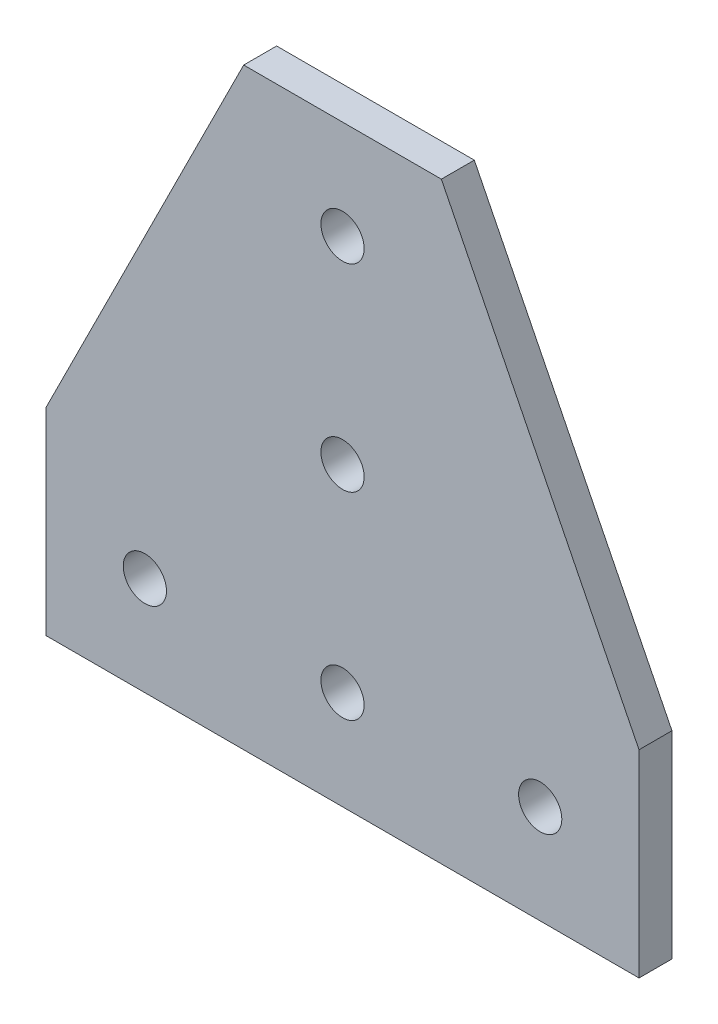
ISO-10303-21;
HEADER;
FILE_DESCRIPTION(('STEP AP214'),'2;1');
FILE_NAME('part.step','',(''),(''),'','','');
FILE_SCHEMA(('AUTOMOTIVE_DESIGN { 1 0 10303 214 1 1 1 1 }'));
ENDSEC;
DATA;
#1=APPLICATION_CONTEXT('core data for automotive mechanical design processes');
#2=APPLICATION_PROTOCOL_DEFINITION('international standard','automotive_design',2000,#1);
#3=PRODUCT_CONTEXT('',#1,'mechanical');
#4=PRODUCT('Part','Part','',(#3));
#5=PRODUCT_RELATED_PRODUCT_CATEGORY('part','',(#4));
#6=PRODUCT_DEFINITION_FORMATION('','',#4);
#7=PRODUCT_DEFINITION_CONTEXT('part definition',#1,'design');
#8=PRODUCT_DEFINITION('design','',#6,#7);
#9=PRODUCT_DEFINITION_SHAPE('','',#8);
#10=(LENGTH_UNIT() NAMED_UNIT(*) SI_UNIT(.MILLI.,.METRE.));
#11=(NAMED_UNIT(*) PLANE_ANGLE_UNIT() SI_UNIT($,.RADIAN.));
#12=(NAMED_UNIT(*) SI_UNIT($,.STERADIAN.) SOLID_ANGLE_UNIT());
#13=UNCERTAINTY_MEASURE_WITH_UNIT(LENGTH_MEASURE(1.E-05),#10,'distance_accuracy_value','');
#14=(GEOMETRIC_REPRESENTATION_CONTEXT(3) GLOBAL_UNCERTAINTY_ASSIGNED_CONTEXT((#13)) GLOBAL_UNIT_ASSIGNED_CONTEXT((#10,
#11,#12)) REPRESENTATION_CONTEXT('',''));
#15=CARTESIAN_POINT('',(0.,0.,0.));
#16=DIRECTION('',(0.,0.,1.));
#17=DIRECTION('',(1.,0.,0.));
#18=AXIS2_PLACEMENT_3D('',#15,#16,#17);
#19=CARTESIAN_POINT('',(0.,0.,3.175));
#20=DIRECTION('',(0.,0.,-1.));
#21=DIRECTION('',(-1.,0.,0.));
#22=AXIS2_PLACEMENT_3D('',#19,#20,#21);
#23=PLANE('',#22);
#24=CARTESIAN_POINT('',(57.15,95.25,3.175));
#25=DIRECTION('',(0.,0.,1.));
#26=DIRECTION('',(1.,0.,0.));
#27=AXIS2_PLACEMENT_3D('',#24,#25,#26);
#28=CIRCLE('',#27,4.1656);
#29=CARTESIAN_POINT('',(61.3156,95.25,3.175));
#30=VERTEX_POINT('',#29);
#31=EDGE_CURVE('E193',#30,#30,#28,.T.);
#32=ORIENTED_EDGE('',*,*,#31,.F.);
#33=EDGE_LOOP('',(#32));
#34=FACE_BOUND('',#33,.T.);
#35=CARTESIAN_POINT('',(57.15,19.05,3.175));
#36=DIRECTION('',(0.,0.,1.));
#37=DIRECTION('',(1.,0.,0.));
#38=AXIS2_PLACEMENT_3D('',#35,#36,#37);
#39=CIRCLE('',#38,4.1656);
#40=CARTESIAN_POINT('',(61.3156,19.05,3.175));
#41=VERTEX_POINT('',#40);
#42=EDGE_CURVE('E205',#41,#41,#39,.T.);
#43=ORIENTED_EDGE('',*,*,#42,.F.);
#44=EDGE_LOOP('',(#43));
#45=FACE_BOUND('',#44,.T.);
#46=DIRECTION('',(1.,0.,0.));
#47=VECTOR('',#46,1.);
#48=CARTESIAN_POINT('',(114.3,0.,3.175));
#49=LINE('',#48,#47);
#50=CARTESIAN_POINT('',(0.,0.,3.175));
#51=VERTEX_POINT('',#50);
#52=CARTESIAN_POINT('',(114.3,0.,3.175));
#53=VERTEX_POINT('',#52);
#54=EDGE_CURVE('E128',#51,#53,#49,.T.);
#55=ORIENTED_EDGE('',*,*,#54,.T.);
#56=DIRECTION('',(0.,1.,0.));
#57=VECTOR('',#56,1.);
#58=CARTESIAN_POINT('',(114.3,38.1,3.175));
#59=LINE('',#58,#57);
#60=CARTESIAN_POINT('',(114.3,38.1,3.175));
#61=VERTEX_POINT('',#60);
#62=EDGE_CURVE('E86',#53,#61,#59,.T.);
#63=ORIENTED_EDGE('',*,*,#62,.T.);
#64=DIRECTION('',(-0.447213595499958,0.894427190999916,0.));
#65=VECTOR('',#64,1.);
#66=CARTESIAN_POINT('',(114.3,38.1,3.175));
#67=LINE('',#66,#65);
#68=CARTESIAN_POINT('',(76.2,114.3,3.175));
#69=VERTEX_POINT('',#68);
#70=EDGE_CURVE('E99',#61,#69,#67,.T.);
#71=ORIENTED_EDGE('',*,*,#70,.T.);
#72=DIRECTION('',(-1.,0.,0.));
#73=VECTOR('',#72,1.);
#74=CARTESIAN_POINT('',(38.1,114.3,3.175));
#75=LINE('',#74,#73);
#76=CARTESIAN_POINT('',(38.1,114.3,3.175));
#77=VERTEX_POINT('',#76);
#78=EDGE_CURVE('E93',#69,#77,#75,.T.);
#79=ORIENTED_EDGE('',*,*,#78,.T.);
#80=DIRECTION('',(-0.447213595499958,-0.894427190999916,0.));
#81=VECTOR('',#80,1.);
#82=CARTESIAN_POINT('',(0.,38.1,3.175));
#83=LINE('',#82,#81);
#84=CARTESIAN_POINT('',(0.,38.1,3.175));
#85=VERTEX_POINT('',#84);
#86=EDGE_CURVE('E97',#77,#85,#83,.T.);
#87=ORIENTED_EDGE('',*,*,#86,.T.);
#88=DIRECTION('',(0.,-1.,0.));
#89=VECTOR('',#88,1.);
#90=CARTESIAN_POINT('',(0.,0.,3.175));
#91=LINE('',#90,#89);
#92=EDGE_CURVE('E49',#85,#51,#91,.T.);
#93=ORIENTED_EDGE('',*,*,#92,.T.);
#94=EDGE_LOOP('',(#55,#63,#71,#79,#87,#93));
#95=FACE_BOUND('',#94,.T.);
#96=CARTESIAN_POINT('',(19.05,19.05,3.175));
#97=DIRECTION('',(0.,0.,1.));
#98=DIRECTION('',(1.,0.,0.));
#99=AXIS2_PLACEMENT_3D('',#96,#97,#98);
#100=CIRCLE('',#99,4.1656);
#101=CARTESIAN_POINT('',(23.2156,19.05,3.175));
#102=VERTEX_POINT('',#101);
#103=EDGE_CURVE('E121',#102,#102,#100,.T.);
#104=ORIENTED_EDGE('',*,*,#103,.F.);
#105=EDGE_LOOP('',(#104));
#106=FACE_BOUND('',#105,.T.);
#107=CARTESIAN_POINT('',(95.25,19.05,3.175));
#108=DIRECTION('',(0.,0.,1.));
#109=DIRECTION('',(1.,0.,0.));
#110=AXIS2_PLACEMENT_3D('',#107,#108,#109);
#111=CIRCLE('',#110,4.1656);
#112=CARTESIAN_POINT('',(99.4156,19.05,3.175));
#113=VERTEX_POINT('',#112);
#114=EDGE_CURVE('E199',#113,#113,#111,.T.);
#115=ORIENTED_EDGE('',*,*,#114,.F.);
#116=EDGE_LOOP('',(#115));
#117=FACE_BOUND('',#116,.T.);
#118=CARTESIAN_POINT('',(57.15,57.15,3.175));
#119=DIRECTION('',(0.,0.,1.));
#120=DIRECTION('',(1.,0.,0.));
#121=AXIS2_PLACEMENT_3D('',#118,#119,#120);
#122=CIRCLE('',#121,4.1656);
#123=CARTESIAN_POINT('',(61.3156,57.15,3.175));
#124=VERTEX_POINT('',#123);
#125=EDGE_CURVE('E184',#124,#124,#122,.T.);
#126=ORIENTED_EDGE('',*,*,#125,.F.);
#127=EDGE_LOOP('',(#126));
#128=FACE_BOUND('',#127,.T.);
#129=ADVANCED_FACE('F32',(#34,#45,#95,#106,#117,#128),#23,.F.);
#130=CARTESIAN_POINT('',(0.,0.,-3.175));
#131=DIRECTION('',(0.,0.,-1.));
#132=DIRECTION('',(-1.,0.,0.));
#133=AXIS2_PLACEMENT_3D('',#130,#131,#132);
#134=PLANE('',#133);
#135=CARTESIAN_POINT('',(57.15,95.25,-3.175));
#136=DIRECTION('',(0.,0.,1.));
#137=DIRECTION('',(1.,0.,0.));
#138=AXIS2_PLACEMENT_3D('',#135,#136,#137);
#139=CIRCLE('',#138,4.1656);
#140=CARTESIAN_POINT('',(61.3156,95.25,-3.175));
#141=VERTEX_POINT('',#140);
#142=EDGE_CURVE('E190',#141,#141,#139,.T.);
#143=ORIENTED_EDGE('',*,*,#142,.T.);
#144=EDGE_LOOP('',(#143));
#145=FACE_BOUND('',#144,.T.);
#146=CARTESIAN_POINT('',(57.15,19.05,-3.175));
#147=DIRECTION('',(0.,0.,1.));
#148=DIRECTION('',(1.,0.,0.));
#149=AXIS2_PLACEMENT_3D('',#146,#147,#148);
#150=CIRCLE('',#149,4.1656);
#151=CARTESIAN_POINT('',(61.3156,19.05,-3.175));
#152=VERTEX_POINT('',#151);
#153=EDGE_CURVE('E202',#152,#152,#150,.T.);
#154=ORIENTED_EDGE('',*,*,#153,.T.);
#155=EDGE_LOOP('',(#154));
#156=FACE_BOUND('',#155,.T.);
#157=DIRECTION('',(1.,0.,0.));
#158=VECTOR('',#157,1.);
#159=CARTESIAN_POINT('',(114.3,0.,-3.175));
#160=LINE('',#159,#158);
#161=CARTESIAN_POINT('',(0.,0.,-3.175));
#162=VERTEX_POINT('',#161);
#163=CARTESIAN_POINT('',(114.3,0.,-3.175));
#164=VERTEX_POINT('',#163);
#165=EDGE_CURVE('E117',#162,#164,#160,.T.);
#166=ORIENTED_EDGE('',*,*,#165,.F.);
#167=DIRECTION('',(0.,-1.,0.));
#168=VECTOR('',#167,1.);
#169=CARTESIAN_POINT('',(0.,0.,-3.175));
#170=LINE('',#169,#168);
#171=CARTESIAN_POINT('',(0.,38.1,-3.175));
#172=VERTEX_POINT('',#171);
#173=EDGE_CURVE('E78',#172,#162,#170,.T.);
#174=ORIENTED_EDGE('',*,*,#173,.F.);
#175=DIRECTION('',(-0.447213595499958,-0.894427190999916,0.));
#176=VECTOR('',#175,1.);
#177=CARTESIAN_POINT('',(0.,38.1,-3.175));
#178=LINE('',#177,#176);
#179=CARTESIAN_POINT('',(38.1,114.3,-3.175));
#180=VERTEX_POINT('',#179);
#181=EDGE_CURVE('E72',#180,#172,#178,.T.);
#182=ORIENTED_EDGE('',*,*,#181,.F.);
#183=DIRECTION('',(-1.,0.,0.));
#184=VECTOR('',#183,1.);
#185=CARTESIAN_POINT('',(38.1,114.3,-3.175));
#186=LINE('',#185,#184);
#187=CARTESIAN_POINT('',(76.2,114.3,-3.175));
#188=VERTEX_POINT('',#187);
#189=EDGE_CURVE('E107',#188,#180,#186,.T.);
#190=ORIENTED_EDGE('',*,*,#189,.F.);
#191=DIRECTION('',(-0.447213595499958,0.894427190999916,0.));
#192=VECTOR('',#191,1.);
#193=CARTESIAN_POINT('',(114.3,38.1,-3.175));
#194=LINE('',#193,#192);
#195=CARTESIAN_POINT('',(114.3,38.1,-3.175));
#196=VERTEX_POINT('',#195);
#197=EDGE_CURVE('E123',#196,#188,#194,.T.);
#198=ORIENTED_EDGE('',*,*,#197,.F.);
#199=DIRECTION('',(0.,1.,0.));
#200=VECTOR('',#199,1.);
#201=CARTESIAN_POINT('',(114.3,38.1,-3.175));
#202=LINE('',#201,#200);
#203=EDGE_CURVE('E120',#164,#196,#202,.T.);
#204=ORIENTED_EDGE('',*,*,#203,.F.);
#205=EDGE_LOOP('',(#166,#174,#182,#190,#198,#204));
#206=FACE_BOUND('',#205,.T.);
#207=CARTESIAN_POINT('',(19.05,19.05,-3.175));
#208=DIRECTION('',(0.,0.,1.));
#209=DIRECTION('',(1.,0.,0.));
#210=AXIS2_PLACEMENT_3D('',#207,#208,#209);
#211=CIRCLE('',#210,4.1656);
#212=CARTESIAN_POINT('',(23.2156,19.05,-3.175));
#213=VERTEX_POINT('',#212);
#214=EDGE_CURVE('E208',#213,#213,#211,.T.);
#215=ORIENTED_EDGE('',*,*,#214,.T.);
#216=EDGE_LOOP('',(#215));
#217=FACE_BOUND('',#216,.T.);
#218=CARTESIAN_POINT('',(95.25,19.05,-3.175));
#219=DIRECTION('',(0.,0.,1.));
#220=DIRECTION('',(1.,0.,0.));
#221=AXIS2_PLACEMENT_3D('',#218,#219,#220);
#222=CIRCLE('',#221,4.1656);
#223=CARTESIAN_POINT('',(99.4156,19.05,-3.175));
#224=VERTEX_POINT('',#223);
#225=EDGE_CURVE('E196',#224,#224,#222,.T.);
#226=ORIENTED_EDGE('',*,*,#225,.T.);
#227=EDGE_LOOP('',(#226));
#228=FACE_BOUND('',#227,.T.);
#229=CARTESIAN_POINT('',(57.15,57.15,-3.175));
#230=DIRECTION('',(0.,0.,1.));
#231=DIRECTION('',(1.,0.,0.));
#232=AXIS2_PLACEMENT_3D('',#229,#230,#231);
#233=CIRCLE('',#232,4.1656);
#234=CARTESIAN_POINT('',(61.3156,57.15,-3.175));
#235=VERTEX_POINT('',#234);
#236=EDGE_CURVE('E187',#235,#235,#233,.T.);
#237=ORIENTED_EDGE('',*,*,#236,.T.);
#238=EDGE_LOOP('',(#237));
#239=FACE_BOUND('',#238,.T.);
#240=ADVANCED_FACE('F137',(#145,#156,#206,#217,#228,#239),#134,.T.);
#241=CARTESIAN_POINT('',(114.3,0.,3.175));
#242=DIRECTION('',(0.,1.,0.));
#243=DIRECTION('',(-1.,0.,0.));
#244=AXIS2_PLACEMENT_3D('',#241,#242,#243);
#245=PLANE('',#244);
#246=ORIENTED_EDGE('',*,*,#165,.T.);
#247=DIRECTION('',(0.,0.,-1.));
#248=VECTOR('',#247,1.);
#249=CARTESIAN_POINT('',(114.3,0.,3.175));
#250=LINE('',#249,#248);
#251=EDGE_CURVE('E11',#53,#164,#250,.T.);
#252=ORIENTED_EDGE('',*,*,#251,.F.);
#253=ORIENTED_EDGE('',*,*,#54,.F.);
#254=DIRECTION('',(0.,0.,-1.));
#255=VECTOR('',#254,1.);
#256=CARTESIAN_POINT('',(0.,0.,3.175));
#257=LINE('',#256,#255);
#258=EDGE_CURVE('E113',#51,#162,#257,.T.);
#259=ORIENTED_EDGE('',*,*,#258,.T.);
#260=EDGE_LOOP('',(#246,#252,#253,#259));
#261=FACE_BOUND('',#260,.T.);
#262=ADVANCED_FACE('F34',(#261),#245,.F.);
#263=CARTESIAN_POINT('',(114.3,38.1,3.175));
#264=DIRECTION('',(-1.,0.,0.));
#265=DIRECTION('',(0.,0.,1.));
#266=AXIS2_PLACEMENT_3D('',#263,#264,#265);
#267=PLANE('',#266);
#268=ORIENTED_EDGE('',*,*,#203,.T.);
#269=DIRECTION('',(0.,0.,-1.));
#270=VECTOR('',#269,1.);
#271=CARTESIAN_POINT('',(114.3,38.1,3.175));
#272=LINE('',#271,#270);
#273=EDGE_CURVE('E41',#61,#196,#272,.T.);
#274=ORIENTED_EDGE('',*,*,#273,.F.);
#275=ORIENTED_EDGE('',*,*,#62,.F.);
#276=ORIENTED_EDGE('',*,*,#251,.T.);
#277=EDGE_LOOP('',(#268,#274,#275,#276));
#278=FACE_BOUND('',#277,.T.);
#279=ADVANCED_FACE('F274',(#278),#267,.F.);
#280=CARTESIAN_POINT('',(114.3,38.1,3.175));
#281=DIRECTION('',(-0.894427190999916,-0.447213595499958,0.));
#282=DIRECTION('',(0.447213595499958,-0.894427190999916,0.));
#283=AXIS2_PLACEMENT_3D('',#280,#281,#282);
#284=PLANE('',#283);
#285=ORIENTED_EDGE('',*,*,#197,.T.);
#286=DIRECTION('',(0.,0.,-1.));
#287=VECTOR('',#286,1.);
#288=CARTESIAN_POINT('',(76.2,114.3,3.175));
#289=LINE('',#288,#287);
#290=EDGE_CURVE('E108',#69,#188,#289,.T.);
#291=ORIENTED_EDGE('',*,*,#290,.F.);
#292=ORIENTED_EDGE('',*,*,#70,.F.);
#293=ORIENTED_EDGE('',*,*,#273,.T.);
#294=EDGE_LOOP('',(#285,#291,#292,#293));
#295=FACE_BOUND('',#294,.T.);
#296=ADVANCED_FACE('F134',(#295),#284,.F.);
#297=CARTESIAN_POINT('',(38.1,114.3,3.175));
#298=DIRECTION('',(0.,-1.,0.));
#299=DIRECTION('',(0.,0.,-1.));
#300=AXIS2_PLACEMENT_3D('',#297,#298,#299);
#301=PLANE('',#300);
#302=ORIENTED_EDGE('',*,*,#189,.T.);
#303=DIRECTION('',(0.,0.,-1.));
#304=VECTOR('',#303,1.);
#305=CARTESIAN_POINT('',(38.1,114.3,3.175));
#306=LINE('',#305,#304);
#307=EDGE_CURVE('E104',#77,#180,#306,.T.);
#308=ORIENTED_EDGE('',*,*,#307,.F.);
#309=ORIENTED_EDGE('',*,*,#78,.F.);
#310=ORIENTED_EDGE('',*,*,#290,.T.);
#311=EDGE_LOOP('',(#302,#308,#309,#310));
#312=FACE_BOUND('',#311,.T.);
#313=ADVANCED_FACE('F105',(#312),#301,.F.);
#314=CARTESIAN_POINT('',(0.,38.1,3.175));
#315=DIRECTION('',(0.894427190999916,-0.447213595499958,0.));
#316=DIRECTION('',(0.447213595499958,0.894427190999916,0.));
#317=AXIS2_PLACEMENT_3D('',#314,#315,#316);
#318=PLANE('',#317);
#319=ORIENTED_EDGE('',*,*,#181,.T.);
#320=DIRECTION('',(0.,0.,-1.));
#321=VECTOR('',#320,1.);
#322=CARTESIAN_POINT('',(0.,38.1,3.175));
#323=LINE('',#322,#321);
#324=EDGE_CURVE('E109',#85,#172,#323,.T.);
#325=ORIENTED_EDGE('',*,*,#324,.F.);
#326=ORIENTED_EDGE('',*,*,#86,.F.);
#327=ORIENTED_EDGE('',*,*,#307,.T.);
#328=EDGE_LOOP('',(#319,#325,#326,#327));
#329=FACE_BOUND('',#328,.T.);
#330=ADVANCED_FACE('F111',(#329),#318,.F.);
#331=CARTESIAN_POINT('',(0.,0.,3.175));
#332=DIRECTION('',(1.,0.,0.));
#333=DIRECTION('',(0.,0.,-1.));
#334=AXIS2_PLACEMENT_3D('',#331,#332,#333);
#335=PLANE('',#334);
#336=ORIENTED_EDGE('',*,*,#173,.T.);
#337=ORIENTED_EDGE('',*,*,#258,.F.);
#338=ORIENTED_EDGE('',*,*,#92,.F.);
#339=ORIENTED_EDGE('',*,*,#324,.T.);
#340=EDGE_LOOP('',(#336,#337,#338,#339));
#341=FACE_BOUND('',#340,.T.);
#342=ADVANCED_FACE('F142',(#341),#335,.F.);
#343=CARTESIAN_POINT('',(19.05,19.05,3.175));
#344=DIRECTION('',(0.,0.,-1.));
#345=DIRECTION('',(-1.,0.,0.));
#346=AXIS2_PLACEMENT_3D('',#343,#344,#345);
#347=CYLINDRICAL_SURFACE('',#346,4.1656);
#348=ORIENTED_EDGE('',*,*,#103,.T.);
#349=EDGE_LOOP('',(#348));
#350=FACE_BOUND('',#349,.T.);
#351=ORIENTED_EDGE('',*,*,#214,.F.);
#352=EDGE_LOOP('',(#351));
#353=FACE_BOUND('',#352,.T.);
#354=ADVANCED_FACE('F144',(#350,#353),#347,.F.);
#355=CARTESIAN_POINT('',(57.15,19.05,3.175));
#356=DIRECTION('',(0.,0.,-1.));
#357=DIRECTION('',(-1.,0.,0.));
#358=AXIS2_PLACEMENT_3D('',#355,#356,#357);
#359=CYLINDRICAL_SURFACE('',#358,4.1656);
#360=ORIENTED_EDGE('',*,*,#42,.T.);
#361=EDGE_LOOP('',(#360));
#362=FACE_BOUND('',#361,.T.);
#363=ORIENTED_EDGE('',*,*,#153,.F.);
#364=EDGE_LOOP('',(#363));
#365=FACE_BOUND('',#364,.T.);
#366=ADVANCED_FACE('F150',(#362,#365),#359,.F.);
#367=CARTESIAN_POINT('',(95.25,19.05,3.175));
#368=DIRECTION('',(0.,0.,-1.));
#369=DIRECTION('',(-1.,0.,0.));
#370=AXIS2_PLACEMENT_3D('',#367,#368,#369);
#371=CYLINDRICAL_SURFACE('',#370,4.1656);
#372=ORIENTED_EDGE('',*,*,#114,.T.);
#373=EDGE_LOOP('',(#372));
#374=FACE_BOUND('',#373,.T.);
#375=ORIENTED_EDGE('',*,*,#225,.F.);
#376=EDGE_LOOP('',(#375));
#377=FACE_BOUND('',#376,.T.);
#378=ADVANCED_FACE('F167',(#374,#377),#371,.F.);
#379=CARTESIAN_POINT('',(57.15,95.25,3.175));
#380=DIRECTION('',(0.,0.,-1.));
#381=DIRECTION('',(-1.,0.,0.));
#382=AXIS2_PLACEMENT_3D('',#379,#380,#381);
#383=CYLINDRICAL_SURFACE('',#382,4.1656);
#384=ORIENTED_EDGE('',*,*,#31,.T.);
#385=EDGE_LOOP('',(#384));
#386=FACE_BOUND('',#385,.T.);
#387=ORIENTED_EDGE('',*,*,#142,.F.);
#388=EDGE_LOOP('',(#387));
#389=FACE_BOUND('',#388,.T.);
#390=ADVANCED_FACE('F171',(#386,#389),#383,.F.);
#391=CARTESIAN_POINT('',(57.15,57.15,3.175));
#392=DIRECTION('',(0.,0.,-1.));
#393=DIRECTION('',(-1.,0.,0.));
#394=AXIS2_PLACEMENT_3D('',#391,#392,#393);
#395=CYLINDRICAL_SURFACE('',#394,4.1656);
#396=ORIENTED_EDGE('',*,*,#125,.T.);
#397=EDGE_LOOP('',(#396));
#398=FACE_BOUND('',#397,.T.);
#399=ORIENTED_EDGE('',*,*,#236,.F.);
#400=EDGE_LOOP('',(#399));
#401=FACE_BOUND('',#400,.T.);
#402=ADVANCED_FACE('F175',(#398,#401),#395,.F.);
#403=CLOSED_SHELL('',(#129,#240,#262,#279,#296,#313,#330,#342,#354,#366,#378,#390,#402));
#404=MANIFOLD_SOLID_BREP('B2',#403);
#405=ADVANCED_BREP_SHAPE_REPRESENTATION('',(#18,#404),#14);
#406=SHAPE_DEFINITION_REPRESENTATION(#9,#405);
ENDSEC;
END-ISO-10303-21;
